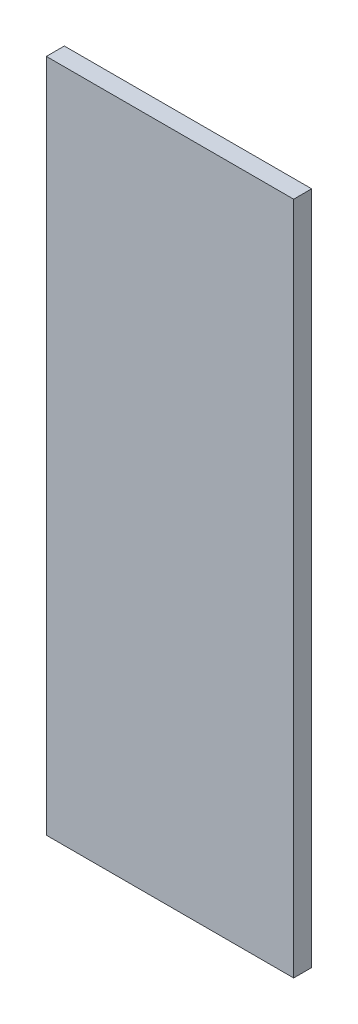
ISO-10303-21;
HEADER;
FILE_DESCRIPTION(('STEP AP214'),'2;1');
FILE_NAME('part.step','',(''),(''),'','','');
FILE_SCHEMA(('AUTOMOTIVE_DESIGN { 1 0 10303 214 1 1 1 1 }'));
ENDSEC;
DATA;
#1=APPLICATION_CONTEXT('core data for automotive mechanical design processes');
#2=APPLICATION_PROTOCOL_DEFINITION('international standard','automotive_design',2000,#1);
#3=PRODUCT_CONTEXT('',#1,'mechanical');
#4=PRODUCT('Part','Part','',(#3));
#5=PRODUCT_RELATED_PRODUCT_CATEGORY('part','',(#4));
#6=PRODUCT_DEFINITION_FORMATION('','',#4);
#7=PRODUCT_DEFINITION_CONTEXT('part definition',#1,'design');
#8=PRODUCT_DEFINITION('design','',#6,#7);
#9=PRODUCT_DEFINITION_SHAPE('','',#8);
#10=(LENGTH_UNIT() NAMED_UNIT(*) SI_UNIT(.MILLI.,.METRE.));
#11=(NAMED_UNIT(*) PLANE_ANGLE_UNIT() SI_UNIT($,.RADIAN.));
#12=(NAMED_UNIT(*) SI_UNIT($,.STERADIAN.) SOLID_ANGLE_UNIT());
#13=UNCERTAINTY_MEASURE_WITH_UNIT(LENGTH_MEASURE(1.E-05),#10,'distance_accuracy_value','');
#14=(GEOMETRIC_REPRESENTATION_CONTEXT(3) GLOBAL_UNCERTAINTY_ASSIGNED_CONTEXT((#13)) GLOBAL_UNIT_ASSIGNED_CONTEXT((#10,
#11,#12)) REPRESENTATION_CONTEXT('',''));
#15=CARTESIAN_POINT('',(0.,0.,0.));
#16=DIRECTION('',(0.,0.,1.));
#17=DIRECTION('',(1.,0.,0.));
#18=AXIS2_PLACEMENT_3D('',#15,#16,#17);
#19=CARTESIAN_POINT('',(0.,0.,4.));
#20=DIRECTION('',(1.,0.,0.));
#21=DIRECTION('',(0.,0.,-1.));
#22=AXIS2_PLACEMENT_3D('',#19,#20,#21);
#23=PLANE('',#22);
#24=DIRECTION('',(0.,-1.,0.));
#25=VECTOR('',#24,1.);
#26=CARTESIAN_POINT('',(0.,0.,0.));
#27=LINE('',#26,#25);
#28=CARTESIAN_POINT('',(0.,150.,0.));
#29=VERTEX_POINT('',#28);
#30=CARTESIAN_POINT('',(0.,0.,0.));
#31=VERTEX_POINT('',#30);
#32=EDGE_CURVE('E107',#29,#31,#27,.T.);
#33=ORIENTED_EDGE('',*,*,#32,.T.);
#34=DIRECTION('',(0.,0.,-1.));
#35=VECTOR('',#34,1.);
#36=CARTESIAN_POINT('',(0.,0.,4.));
#37=LINE('',#36,#35);
#38=CARTESIAN_POINT('',(0.,0.,4.));
#39=VERTEX_POINT('',#38);
#40=EDGE_CURVE('E11',#39,#31,#37,.T.);
#41=ORIENTED_EDGE('',*,*,#40,.F.);
#42=DIRECTION('',(0.,-1.,0.));
#43=VECTOR('',#42,1.);
#44=CARTESIAN_POINT('',(0.,0.,4.));
#45=LINE('',#44,#43);
#46=CARTESIAN_POINT('',(0.,150.,4.));
#47=VERTEX_POINT('',#46);
#48=EDGE_CURVE('E91',#47,#39,#45,.T.);
#49=ORIENTED_EDGE('',*,*,#48,.F.);
#50=DIRECTION('',(0.,0.,-1.));
#51=VECTOR('',#50,1.);
#52=CARTESIAN_POINT('',(0.,150.,4.));
#53=LINE('',#52,#51);
#54=EDGE_CURVE('E103',#47,#29,#53,.T.);
#55=ORIENTED_EDGE('',*,*,#54,.T.);
#56=EDGE_LOOP('',(#33,#41,#49,#55));
#57=FACE_BOUND('',#56,.T.);
#58=ADVANCED_FACE('F39',(#57),#23,.F.);
#59=CARTESIAN_POINT('',(0.,0.,4.));
#60=DIRECTION('',(0.,1.,0.));
#61=DIRECTION('',(0.,0.,1.));
#62=AXIS2_PLACEMENT_3D('',#59,#60,#61);
#63=PLANE('',#62);
#64=DIRECTION('',(1.,0.,0.));
#65=VECTOR('',#64,1.);
#66=CARTESIAN_POINT('',(0.,0.,0.));
#67=LINE('',#66,#65);
#68=CARTESIAN_POINT('',(55.,0.,0.));
#69=VERTEX_POINT('',#68);
#70=EDGE_CURVE('E96',#31,#69,#67,.T.);
#71=ORIENTED_EDGE('',*,*,#70,.T.);
#72=DIRECTION('',(0.,0.,-1.));
#73=VECTOR('',#72,1.);
#74=CARTESIAN_POINT('',(55.,0.,4.));
#75=LINE('',#74,#73);
#76=CARTESIAN_POINT('',(55.,0.,4.));
#77=VERTEX_POINT('',#76);
#78=EDGE_CURVE('E48',#77,#69,#75,.T.);
#79=ORIENTED_EDGE('',*,*,#78,.F.);
#80=DIRECTION('',(1.,0.,0.));
#81=VECTOR('',#80,1.);
#82=CARTESIAN_POINT('',(0.,0.,4.));
#83=LINE('',#82,#81);
#84=EDGE_CURVE('E86',#39,#77,#83,.T.);
#85=ORIENTED_EDGE('',*,*,#84,.F.);
#86=ORIENTED_EDGE('',*,*,#40,.T.);
#87=EDGE_LOOP('',(#71,#79,#85,#86));
#88=FACE_BOUND('',#87,.T.);
#89=ADVANCED_FACE('F95',(#88),#63,.F.);
#90=CARTESIAN_POINT('',(55.,0.,4.));
#91=DIRECTION('',(-1.,0.,0.));
#92=DIRECTION('',(0.,0.,1.));
#93=AXIS2_PLACEMENT_3D('',#90,#91,#92);
#94=PLANE('',#93);
#95=DIRECTION('',(0.,1.,0.));
#96=VECTOR('',#95,1.);
#97=CARTESIAN_POINT('',(55.,0.,0.));
#98=LINE('',#97,#96);
#99=CARTESIAN_POINT('',(55.,150.,0.));
#100=VERTEX_POINT('',#99);
#101=EDGE_CURVE('E73',#69,#100,#98,.T.);
#102=ORIENTED_EDGE('',*,*,#101,.T.);
#103=DIRECTION('',(0.,0.,-1.));
#104=VECTOR('',#103,1.);
#105=CARTESIAN_POINT('',(55.,150.,4.));
#106=LINE('',#105,#104);
#107=CARTESIAN_POINT('',(55.,150.,4.));
#108=VERTEX_POINT('',#107);
#109=EDGE_CURVE('E98',#108,#100,#106,.T.);
#110=ORIENTED_EDGE('',*,*,#109,.F.);
#111=DIRECTION('',(0.,1.,0.));
#112=VECTOR('',#111,1.);
#113=CARTESIAN_POINT('',(55.,0.,4.));
#114=LINE('',#113,#112);
#115=EDGE_CURVE('E89',#77,#108,#114,.T.);
#116=ORIENTED_EDGE('',*,*,#115,.F.);
#117=ORIENTED_EDGE('',*,*,#78,.T.);
#118=EDGE_LOOP('',(#102,#110,#116,#117));
#119=FACE_BOUND('',#118,.T.);
#120=ADVANCED_FACE('F99',(#119),#94,.F.);
#121=CARTESIAN_POINT('',(0.,150.,4.));
#122=DIRECTION('',(0.,-1.,0.));
#123=DIRECTION('',(0.,0.,-1.));
#124=AXIS2_PLACEMENT_3D('',#121,#122,#123);
#125=PLANE('',#124);
#126=DIRECTION('',(-1.,0.,0.));
#127=VECTOR('',#126,1.);
#128=CARTESIAN_POINT('',(0.,150.,0.));
#129=LINE('',#128,#127);
#130=EDGE_CURVE('E79',#100,#29,#129,.T.);
#131=ORIENTED_EDGE('',*,*,#130,.T.);
#132=ORIENTED_EDGE('',*,*,#54,.F.);
#133=DIRECTION('',(-1.,0.,0.));
#134=VECTOR('',#133,1.);
#135=CARTESIAN_POINT('',(0.,150.,4.));
#136=LINE('',#135,#134);
#137=EDGE_CURVE('E56',#108,#47,#136,.T.);
#138=ORIENTED_EDGE('',*,*,#137,.F.);
#139=ORIENTED_EDGE('',*,*,#109,.T.);
#140=EDGE_LOOP('',(#131,#132,#138,#139));
#141=FACE_BOUND('',#140,.T.);
#142=ADVANCED_FACE('F120',(#141),#125,.F.);
#143=CARTESIAN_POINT('',(0.,0.,4.));
#144=DIRECTION('',(0.,0.,-1.));
#145=DIRECTION('',(-1.,0.,0.));
#146=AXIS2_PLACEMENT_3D('',#143,#144,#145);
#147=PLANE('',#146);
#148=ORIENTED_EDGE('',*,*,#48,.T.);
#149=ORIENTED_EDGE('',*,*,#84,.T.);
#150=ORIENTED_EDGE('',*,*,#115,.T.);
#151=ORIENTED_EDGE('',*,*,#137,.T.);
#152=EDGE_LOOP('',(#148,#149,#150,#151));
#153=FACE_BOUND('',#152,.T.);
#154=ADVANCED_FACE('F87',(#153),#147,.F.);
#155=CARTESIAN_POINT('',(0.,0.,0.));
#156=DIRECTION('',(0.,0.,-1.));
#157=DIRECTION('',(-1.,0.,0.));
#158=AXIS2_PLACEMENT_3D('',#155,#156,#157);
#159=PLANE('',#158);
#160=ORIENTED_EDGE('',*,*,#32,.F.);
#161=ORIENTED_EDGE('',*,*,#130,.F.);
#162=ORIENTED_EDGE('',*,*,#101,.F.);
#163=ORIENTED_EDGE('',*,*,#70,.F.);
#164=EDGE_LOOP('',(#160,#161,#162,#163));
#165=FACE_BOUND('',#164,.T.);
#166=ADVANCED_FACE('F123',(#165),#159,.T.);
#167=CLOSED_SHELL('',(#58,#89,#120,#142,#154,#166));
#168=MANIFOLD_SOLID_BREP('B2',#167);
#169=ADVANCED_BREP_SHAPE_REPRESENTATION('',(#18,#168),#14);
#170=SHAPE_DEFINITION_REPRESENTATION(#9,#169);
ENDSEC;
END-ISO-10303-21;
